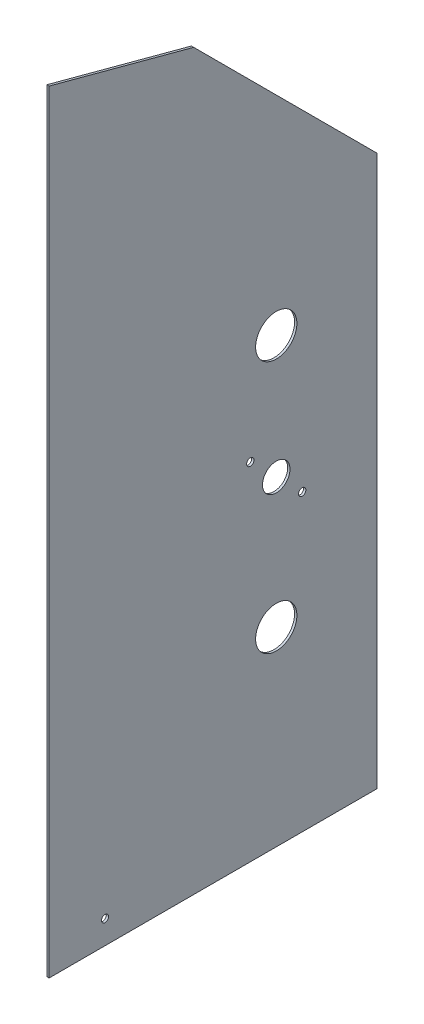
ISO-10303-21;
HEADER;
FILE_DESCRIPTION(('STEP AP214'),'2;1');
FILE_NAME('part.step','',(''),(''),'','','');
FILE_SCHEMA(('AUTOMOTIVE_DESIGN { 1 0 10303 214 1 1 1 1 }'));
ENDSEC;
DATA;
#1=APPLICATION_CONTEXT('core data for automotive mechanical design processes');
#2=APPLICATION_PROTOCOL_DEFINITION('international standard','automotive_design',2000,#1);
#3=PRODUCT_CONTEXT('',#1,'mechanical');
#4=PRODUCT('Part','Part','',(#3));
#5=PRODUCT_RELATED_PRODUCT_CATEGORY('part','',(#4));
#6=PRODUCT_DEFINITION_FORMATION('','',#4);
#7=PRODUCT_DEFINITION_CONTEXT('part definition',#1,'design');
#8=PRODUCT_DEFINITION('design','',#6,#7);
#9=PRODUCT_DEFINITION_SHAPE('','',#8);
#10=(LENGTH_UNIT() NAMED_UNIT(*) SI_UNIT(.MILLI.,.METRE.));
#11=(NAMED_UNIT(*) PLANE_ANGLE_UNIT() SI_UNIT($,.RADIAN.));
#12=(NAMED_UNIT(*) SI_UNIT($,.STERADIAN.) SOLID_ANGLE_UNIT());
#13=UNCERTAINTY_MEASURE_WITH_UNIT(LENGTH_MEASURE(1.E-05),#10,'distance_accuracy_value','');
#14=(GEOMETRIC_REPRESENTATION_CONTEXT(3) GLOBAL_UNCERTAINTY_ASSIGNED_CONTEXT((#13)) GLOBAL_UNIT_ASSIGNED_CONTEXT((#10,
#11,#12)) REPRESENTATION_CONTEXT('',''));
#15=CARTESIAN_POINT('',(0.,0.,0.));
#16=DIRECTION('',(0.,0.,1.));
#17=DIRECTION('',(1.,0.,0.));
#18=AXIS2_PLACEMENT_3D('',#15,#16,#17);
#19=CARTESIAN_POINT('',(1.5875,0.,0.));
#20=DIRECTION('',(1.,0.,0.));
#21=DIRECTION('',(0.,0.,-1.));
#22=AXIS2_PLACEMENT_3D('',#19,#20,#21);
#23=PLANE('',#22);
#24=CARTESIAN_POINT('',(1.5875,-237.687866,74.877168));
#25=DIRECTION('',(1.,0.,0.));
#26=DIRECTION('',(0.,0.,-1.));
#27=AXIS2_PLACEMENT_3D('',#24,#25,#26);
#28=CIRCLE('',#27,2.45745);
#29=CARTESIAN_POINT('',(1.5875,-237.687866,72.419718));
#30=VERTEX_POINT('',#29);
#31=EDGE_CURVE('E152',#30,#30,#28,.T.);
#32=ORIENTED_EDGE('',*,*,#31,.F.);
#33=EDGE_LOOP('',(#32));
#34=FACE_BOUND('',#33,.T.);
#35=CARTESIAN_POINT('',(1.5875,-14.2543077578617,-25.7274877578617));
#36=DIRECTION('',(1.,0.,0.));
#37=DIRECTION('',(0.,0.,-1.));
#38=AXIS2_PLACEMENT_3D('',#35,#36,#37);
#39=CIRCLE('',#38,2.55270000000001);
#40=CARTESIAN_POINT('',(1.5875,-14.2543077578617,-28.2801877578617));
#41=VERTEX_POINT('',#40);
#42=EDGE_CURVE('E135',#41,#41,#39,.T.);
#43=ORIENTED_EDGE('',*,*,#42,.F.);
#44=EDGE_LOOP('',(#43));
#45=FACE_BOUND('',#44,.T.);
#46=CARTESIAN_POINT('',(1.5875,52.78628,-43.688));
#47=DIRECTION('',(1.,0.,0.));
#48=DIRECTION('',(0.,0.,-1.));
#49=AXIS2_PLACEMENT_3D('',#46,#47,#48);
#50=CIRCLE('',#49,14.2875);
#51=CARTESIAN_POINT('',(1.5875,52.78628,-57.9755));
#52=VERTEX_POINT('',#51);
#53=EDGE_CURVE('E123',#52,#52,#50,.T.);
#54=ORIENTED_EDGE('',*,*,#53,.F.);
#55=EDGE_LOOP('',(#54));
#56=FACE_BOUND('',#55,.T.);
#57=DIRECTION('',(0.,1.,0.));
#58=VECTOR('',#57,1.);
#59=CARTESIAN_POINT('',(1.5875,254.,-113.538));
#60=LINE('',#59,#58);
#61=CARTESIAN_POINT('',(1.5875,-254.,-113.538));
#62=VERTEX_POINT('',#61);
#63=CARTESIAN_POINT('',(1.5875,127.,-113.538));
#64=VERTEX_POINT('',#63);
#65=EDGE_CURVE('E111',#62,#64,#60,.T.);
#66=ORIENTED_EDGE('',*,*,#65,.T.);
#67=DIRECTION('',(0.,-0.707106781186549,-0.707106781186546));
#68=VECTOR('',#67,1.);
#69=CARTESIAN_POINT('',(1.5875,120.269,-120.269));
#70=LINE('',#69,#68);
#71=CARTESIAN_POINT('',(1.5875,254.,13.462));
#72=VERTEX_POINT('',#71);
#73=EDGE_CURVE('E11',#64,#72,#70,.F.);
#74=ORIENTED_EDGE('',*,*,#73,.T.);
#75=DIRECTION('',(0.,0.258819045102515,0.96592582628907));
#76=VECTOR('',#75,1.);
#77=CARTESIAN_POINT('',(1.5875,254.,13.462));
#78=LINE('',#77,#76);
#79=CARTESIAN_POINT('',(1.5875,280.815283381736,113.538));
#80=VERTEX_POINT('',#79);
#81=EDGE_CURVE('E89',#72,#80,#78,.T.);
#82=ORIENTED_EDGE('',*,*,#81,.T.);
#83=DIRECTION('',(0.,-1.,0.));
#84=VECTOR('',#83,1.);
#85=CARTESIAN_POINT('',(1.5875,254.,113.538));
#86=LINE('',#85,#84);
#87=CARTESIAN_POINT('',(1.5875,-254.,113.538));
#88=VERTEX_POINT('',#87);
#89=EDGE_CURVE('E117',#80,#88,#86,.T.);
#90=ORIENTED_EDGE('',*,*,#89,.T.);
#91=DIRECTION('',(0.,0.,-1.));
#92=VECTOR('',#91,1.);
#93=CARTESIAN_POINT('',(1.5875,-254.,113.538));
#94=LINE('',#93,#92);
#95=EDGE_CURVE('E108',#88,#62,#94,.T.);
#96=ORIENTED_EDGE('',*,*,#95,.T.);
#97=EDGE_LOOP('',(#66,#74,#82,#90,#96));
#98=FACE_BOUND('',#97,.T.);
#99=CARTESIAN_POINT('',(1.5875,-122.2375,-43.688));
#100=DIRECTION('',(1.,0.,0.));
#101=DIRECTION('',(0.,0.,-1.));
#102=AXIS2_PLACEMENT_3D('',#99,#100,#101);
#103=CIRCLE('',#102,14.2875);
#104=CARTESIAN_POINT('',(1.5875,-122.2375,-57.9755));
#105=VERTEX_POINT('',#104);
#106=EDGE_CURVE('E115',#105,#105,#103,.T.);
#107=ORIENTED_EDGE('',*,*,#106,.F.);
#108=EDGE_LOOP('',(#107));
#109=FACE_BOUND('',#108,.T.);
#110=CARTESIAN_POINT('',(1.5875,-32.21482,-43.688));
#111=DIRECTION('',(1.,0.,0.));
#112=DIRECTION('',(0.,0.,-1.));
#113=AXIS2_PLACEMENT_3D('',#110,#111,#112);
#114=CIRCLE('',#113,9.525);
#115=CARTESIAN_POINT('',(1.5875,-32.21482,-53.213));
#116=VERTEX_POINT('',#115);
#117=EDGE_CURVE('E129',#116,#116,#114,.T.);
#118=ORIENTED_EDGE('',*,*,#117,.F.);
#119=EDGE_LOOP('',(#118));
#120=FACE_BOUND('',#119,.T.);
#121=CARTESIAN_POINT('',(1.5875,-50.1753322421383,-61.6485122421384));
#122=DIRECTION('',(1.,0.,0.));
#123=DIRECTION('',(0.,0.,-1.));
#124=AXIS2_PLACEMENT_3D('',#121,#122,#123);
#125=CIRCLE('',#124,2.55270000000003);
#126=CARTESIAN_POINT('',(1.5875,-50.1753322421383,-64.2012122421384));
#127=VERTEX_POINT('',#126);
#128=EDGE_CURVE('E141',#127,#127,#125,.T.);
#129=ORIENTED_EDGE('',*,*,#128,.F.);
#130=EDGE_LOOP('',(#129));
#131=FACE_BOUND('',#130,.T.);
#132=ADVANCED_FACE('F35',(#34,#45,#56,#98,#109,#120,#131),#23,.T.);
#133=CARTESIAN_POINT('',(0.,0.,0.));
#134=DIRECTION('',(1.,0.,0.));
#135=DIRECTION('',(0.,0.,-1.));
#136=AXIS2_PLACEMENT_3D('',#133,#134,#135);
#137=PLANE('',#136);
#138=CARTESIAN_POINT('',(0.,-237.687866,74.877168));
#139=DIRECTION('',(1.,0.,0.));
#140=DIRECTION('',(0.,0.,-1.));
#141=AXIS2_PLACEMENT_3D('',#138,#139,#140);
#142=CIRCLE('',#141,2.45745);
#143=CARTESIAN_POINT('',(0.,-237.687866,72.419718));
#144=VERTEX_POINT('',#143);
#145=EDGE_CURVE('E147',#144,#144,#142,.T.);
#146=ORIENTED_EDGE('',*,*,#145,.T.);
#147=EDGE_LOOP('',(#146));
#148=FACE_BOUND('',#147,.T.);
#149=DIRECTION('',(0.,-1.,0.));
#150=VECTOR('',#149,1.);
#151=CARTESIAN_POINT('',(0.,254.,113.538));
#152=LINE('',#151,#150);
#153=CARTESIAN_POINT('',(0.,280.815283381736,113.538));
#154=VERTEX_POINT('',#153);
#155=CARTESIAN_POINT('',(0.,-254.,113.538));
#156=VERTEX_POINT('',#155);
#157=EDGE_CURVE('E97',#154,#156,#152,.T.);
#158=ORIENTED_EDGE('',*,*,#157,.F.);
#159=DIRECTION('',(0.,0.258819045102515,0.96592582628907));
#160=VECTOR('',#159,1.);
#161=CARTESIAN_POINT('',(0.,254.,13.462));
#162=LINE('',#161,#160);
#163=CARTESIAN_POINT('',(0.,254.,13.462));
#164=VERTEX_POINT('',#163);
#165=EDGE_CURVE('E87',#164,#154,#162,.T.);
#166=ORIENTED_EDGE('',*,*,#165,.F.);
#167=DIRECTION('',(0.,0.707106781186549,0.707106781186546));
#168=VECTOR('',#167,1.);
#169=CARTESIAN_POINT('',(0.,254.,13.462));
#170=LINE('',#169,#168);
#171=CARTESIAN_POINT('',(0.,127.,-113.538));
#172=VERTEX_POINT('',#171);
#173=EDGE_CURVE('E57',#164,#172,#170,.F.);
#174=ORIENTED_EDGE('',*,*,#173,.T.);
#175=DIRECTION('',(0.,1.,0.));
#176=VECTOR('',#175,1.);
#177=CARTESIAN_POINT('',(0.,254.,-113.538));
#178=LINE('',#177,#176);
#179=CARTESIAN_POINT('',(0.,-254.,-113.538));
#180=VERTEX_POINT('',#179);
#181=EDGE_CURVE('E113',#180,#172,#178,.T.);
#182=ORIENTED_EDGE('',*,*,#181,.F.);
#183=DIRECTION('',(0.,0.,-1.));
#184=VECTOR('',#183,1.);
#185=CARTESIAN_POINT('',(0.,-254.,113.538));
#186=LINE('',#185,#184);
#187=EDGE_CURVE('E109',#156,#180,#186,.T.);
#188=ORIENTED_EDGE('',*,*,#187,.F.);
#189=EDGE_LOOP('',(#158,#166,#174,#182,#188));
#190=FACE_BOUND('',#189,.T.);
#191=CARTESIAN_POINT('',(0.,-122.2375,-43.688));
#192=DIRECTION('',(1.,0.,0.));
#193=DIRECTION('',(0.,0.,-1.));
#194=AXIS2_PLACEMENT_3D('',#191,#192,#193);
#195=CIRCLE('',#194,14.2875);
#196=CARTESIAN_POINT('',(0.,-122.2375,-57.9755));
#197=VERTEX_POINT('',#196);
#198=EDGE_CURVE('E120',#197,#197,#195,.T.);
#199=ORIENTED_EDGE('',*,*,#198,.T.);
#200=EDGE_LOOP('',(#199));
#201=FACE_BOUND('',#200,.T.);
#202=CARTESIAN_POINT('',(0.,52.78628,-43.688));
#203=DIRECTION('',(1.,0.,0.));
#204=DIRECTION('',(0.,0.,-1.));
#205=AXIS2_PLACEMENT_3D('',#202,#203,#204);
#206=CIRCLE('',#205,14.2875);
#207=CARTESIAN_POINT('',(0.,52.78628,-57.9755));
#208=VERTEX_POINT('',#207);
#209=EDGE_CURVE('E126',#208,#208,#206,.T.);
#210=ORIENTED_EDGE('',*,*,#209,.T.);
#211=EDGE_LOOP('',(#210));
#212=FACE_BOUND('',#211,.T.);
#213=CARTESIAN_POINT('',(0.,-32.21482,-43.688));
#214=DIRECTION('',(1.,0.,0.));
#215=DIRECTION('',(0.,0.,-1.));
#216=AXIS2_PLACEMENT_3D('',#213,#214,#215);
#217=CIRCLE('',#216,9.525);
#218=CARTESIAN_POINT('',(0.,-32.21482,-53.213));
#219=VERTEX_POINT('',#218);
#220=EDGE_CURVE('E132',#219,#219,#217,.T.);
#221=ORIENTED_EDGE('',*,*,#220,.T.);
#222=EDGE_LOOP('',(#221));
#223=FACE_BOUND('',#222,.T.);
#224=CARTESIAN_POINT('',(0.,-14.2543077578617,-25.7274877578617));
#225=DIRECTION('',(1.,0.,0.));
#226=DIRECTION('',(0.,0.,-1.));
#227=AXIS2_PLACEMENT_3D('',#224,#225,#226);
#228=CIRCLE('',#227,2.55270000000001);
#229=CARTESIAN_POINT('',(0.,-14.2543077578617,-28.2801877578617));
#230=VERTEX_POINT('',#229);
#231=EDGE_CURVE('E138',#230,#230,#228,.T.);
#232=ORIENTED_EDGE('',*,*,#231,.T.);
#233=EDGE_LOOP('',(#232));
#234=FACE_BOUND('',#233,.T.);
#235=CARTESIAN_POINT('',(0.,-50.1753322421383,-61.6485122421384));
#236=DIRECTION('',(1.,0.,0.));
#237=DIRECTION('',(0.,0.,-1.));
#238=AXIS2_PLACEMENT_3D('',#235,#236,#237);
#239=CIRCLE('',#238,2.55270000000003);
#240=CARTESIAN_POINT('',(0.,-50.1753322421383,-64.2012122421384));
#241=VERTEX_POINT('',#240);
#242=EDGE_CURVE('E144',#241,#241,#239,.T.);
#243=ORIENTED_EDGE('',*,*,#242,.T.);
#244=EDGE_LOOP('',(#243));
#245=FACE_BOUND('',#244,.T.);
#246=ADVANCED_FACE('F94',(#148,#190,#201,#212,#223,#234,#245),#137,.F.);
#247=CARTESIAN_POINT('',(1.5875,254.,-113.538));
#248=DIRECTION('',(0.,0.,1.));
#249=DIRECTION('',(0.,-1.,0.));
#250=AXIS2_PLACEMENT_3D('',#247,#248,#249);
#251=PLANE('',#250);
#252=ORIENTED_EDGE('',*,*,#181,.T.);
#253=DIRECTION('',(1.,0.,0.));
#254=VECTOR('',#253,1.);
#255=CARTESIAN_POINT('',(1.5875,127.,-113.538));
#256=LINE('',#255,#254);
#257=EDGE_CURVE('E43',#172,#64,#256,.T.);
#258=ORIENTED_EDGE('',*,*,#257,.T.);
#259=ORIENTED_EDGE('',*,*,#65,.F.);
#260=DIRECTION('',(-1.,0.,0.));
#261=VECTOR('',#260,1.);
#262=CARTESIAN_POINT('',(1.5875,-254.,-113.538));
#263=LINE('',#262,#261);
#264=EDGE_CURVE('E105',#62,#180,#263,.T.);
#265=ORIENTED_EDGE('',*,*,#264,.T.);
#266=EDGE_LOOP('',(#252,#258,#259,#265));
#267=FACE_BOUND('',#266,.T.);
#268=ADVANCED_FACE('F161',(#267),#251,.F.);
#269=CARTESIAN_POINT('',(1.5875,254.,113.538));
#270=DIRECTION('',(0.,0.,-1.));
#271=DIRECTION('',(0.,1.,0.));
#272=AXIS2_PLACEMENT_3D('',#269,#270,#271);
#273=PLANE('',#272);
#274=ORIENTED_EDGE('',*,*,#157,.T.);
#275=DIRECTION('',(-1.,0.,0.));
#276=VECTOR('',#275,1.);
#277=CARTESIAN_POINT('',(1.5875,-254.,113.538));
#278=LINE('',#277,#276);
#279=EDGE_CURVE('E92',#88,#156,#278,.T.);
#280=ORIENTED_EDGE('',*,*,#279,.F.);
#281=ORIENTED_EDGE('',*,*,#89,.F.);
#282=DIRECTION('',(1.,0.,0.));
#283=VECTOR('',#282,1.);
#284=CARTESIAN_POINT('',(0.,280.815283381736,113.538));
#285=LINE('',#284,#283);
#286=EDGE_CURVE('E99',#154,#80,#285,.T.);
#287=ORIENTED_EDGE('',*,*,#286,.F.);
#288=EDGE_LOOP('',(#274,#280,#281,#287));
#289=FACE_BOUND('',#288,.T.);
#290=ADVANCED_FACE('F165',(#289),#273,.F.);
#291=CARTESIAN_POINT('',(1.5875,-254.,113.538));
#292=DIRECTION('',(0.,1.,0.));
#293=DIRECTION('',(0.,0.,1.));
#294=AXIS2_PLACEMENT_3D('',#291,#292,#293);
#295=PLANE('',#294);
#296=ORIENTED_EDGE('',*,*,#187,.T.);
#297=ORIENTED_EDGE('',*,*,#264,.F.);
#298=ORIENTED_EDGE('',*,*,#95,.F.);
#299=ORIENTED_EDGE('',*,*,#279,.T.);
#300=EDGE_LOOP('',(#296,#297,#298,#299));
#301=FACE_BOUND('',#300,.T.);
#302=ADVANCED_FACE('F163',(#301),#295,.F.);
#303=CARTESIAN_POINT('',(1.5875,-122.2375,-43.688));
#304=DIRECTION('',(-1.,0.,0.));
#305=DIRECTION('',(0.,0.,1.));
#306=AXIS2_PLACEMENT_3D('',#303,#304,#305);
#307=CYLINDRICAL_SURFACE('',#306,14.2875);
#308=ORIENTED_EDGE('',*,*,#106,.T.);
#309=EDGE_LOOP('',(#308));
#310=FACE_BOUND('',#309,.T.);
#311=ORIENTED_EDGE('',*,*,#198,.F.);
#312=EDGE_LOOP('',(#311));
#313=FACE_BOUND('',#312,.T.);
#314=ADVANCED_FACE('F172',(#310,#313),#307,.F.);
#315=CARTESIAN_POINT('',(1.5875,52.78628,-43.688));
#316=DIRECTION('',(-1.,0.,0.));
#317=DIRECTION('',(0.,0.,1.));
#318=AXIS2_PLACEMENT_3D('',#315,#316,#317);
#319=CYLINDRICAL_SURFACE('',#318,14.2875);
#320=ORIENTED_EDGE('',*,*,#53,.T.);
#321=EDGE_LOOP('',(#320));
#322=FACE_BOUND('',#321,.T.);
#323=ORIENTED_EDGE('',*,*,#209,.F.);
#324=EDGE_LOOP('',(#323));
#325=FACE_BOUND('',#324,.T.);
#326=ADVANCED_FACE('F187',(#322,#325),#319,.F.);
#327=CARTESIAN_POINT('',(1.5875,-32.21482,-43.688));
#328=DIRECTION('',(-1.,0.,0.));
#329=DIRECTION('',(0.,0.,1.));
#330=AXIS2_PLACEMENT_3D('',#327,#328,#329);
#331=CYLINDRICAL_SURFACE('',#330,9.525);
#332=ORIENTED_EDGE('',*,*,#117,.T.);
#333=EDGE_LOOP('',(#332));
#334=FACE_BOUND('',#333,.T.);
#335=ORIENTED_EDGE('',*,*,#220,.F.);
#336=EDGE_LOOP('',(#335));
#337=FACE_BOUND('',#336,.T.);
#338=ADVANCED_FACE('F191',(#334,#337),#331,.F.);
#339=CARTESIAN_POINT('',(1.5875,-14.2543077578617,-25.7274877578617));
#340=DIRECTION('',(-1.,0.,0.));
#341=DIRECTION('',(0.,0.,1.));
#342=AXIS2_PLACEMENT_3D('',#339,#340,#341);
#343=CYLINDRICAL_SURFACE('',#342,2.55270000000001);
#344=ORIENTED_EDGE('',*,*,#42,.T.);
#345=EDGE_LOOP('',(#344));
#346=FACE_BOUND('',#345,.T.);
#347=ORIENTED_EDGE('',*,*,#231,.F.);
#348=EDGE_LOOP('',(#347));
#349=FACE_BOUND('',#348,.T.);
#350=ADVANCED_FACE('F195',(#346,#349),#343,.F.);
#351=CARTESIAN_POINT('',(1.5875,-50.1753322421383,-61.6485122421384));
#352=DIRECTION('',(-1.,0.,0.));
#353=DIRECTION('',(0.,0.,1.));
#354=AXIS2_PLACEMENT_3D('',#351,#352,#353);
#355=CYLINDRICAL_SURFACE('',#354,2.55270000000003);
#356=ORIENTED_EDGE('',*,*,#128,.T.);
#357=EDGE_LOOP('',(#356));
#358=FACE_BOUND('',#357,.T.);
#359=ORIENTED_EDGE('',*,*,#242,.F.);
#360=EDGE_LOOP('',(#359));
#361=FACE_BOUND('',#360,.T.);
#362=ADVANCED_FACE('F199',(#358,#361),#355,.F.);
#363=CARTESIAN_POINT('',(1.5875,-237.687866,74.877168));
#364=DIRECTION('',(1.,0.,0.));
#365=DIRECTION('',(0.,0.,-1.));
#366=AXIS2_PLACEMENT_3D('',#363,#364,#365);
#367=CYLINDRICAL_SURFACE('',#366,2.45745);
#368=ORIENTED_EDGE('',*,*,#145,.F.);
#369=EDGE_LOOP('',(#368));
#370=FACE_BOUND('',#369,.T.);
#371=ORIENTED_EDGE('',*,*,#31,.T.);
#372=EDGE_LOOP('',(#371));
#373=FACE_BOUND('',#372,.T.);
#374=ADVANCED_FACE('F203',(#370,#373),#367,.F.);
#375=CARTESIAN_POINT('',(1.5875,254.,13.462));
#376=DIRECTION('',(0.,-0.707106781186546,0.707106781186549));
#377=DIRECTION('',(-1.,0.,0.));
#378=AXIS2_PLACEMENT_3D('',#375,#376,#377);
#379=PLANE('',#378);
#380=ORIENTED_EDGE('',*,*,#73,.F.);
#381=ORIENTED_EDGE('',*,*,#257,.F.);
#382=ORIENTED_EDGE('',*,*,#173,.F.);
#383=DIRECTION('',(-1.,0.,0.));
#384=VECTOR('',#383,1.);
#385=CARTESIAN_POINT('',(1.5875,254.,13.462));
#386=LINE('',#385,#384);
#387=EDGE_CURVE('E84',#72,#164,#386,.T.);
#388=ORIENTED_EDGE('',*,*,#387,.F.);
#389=EDGE_LOOP('',(#380,#381,#382,#388));
#390=FACE_BOUND('',#389,.T.);
#391=ADVANCED_FACE('F37',(#390),#379,.F.);
#392=CARTESIAN_POINT('',(0.,254.,13.462));
#393=DIRECTION('',(0.,0.96592582628907,-0.258819045102515));
#394=DIRECTION('',(0.,0.258819045102515,0.96592582628907));
#395=AXIS2_PLACEMENT_3D('',#392,#393,#394);
#396=PLANE('',#395);
#397=ORIENTED_EDGE('',*,*,#81,.F.);
#398=ORIENTED_EDGE('',*,*,#387,.T.);
#399=ORIENTED_EDGE('',*,*,#165,.T.);
#400=ORIENTED_EDGE('',*,*,#286,.T.);
#401=EDGE_LOOP('',(#397,#398,#399,#400));
#402=FACE_BOUND('',#401,.T.);
#403=ADVANCED_FACE('F85',(#402),#396,.T.);
#404=CLOSED_SHELL('',(#132,#246,#268,#290,#302,#314,#326,#338,#350,#362,#374,#391,#403));
#405=MANIFOLD_SOLID_BREP('B2',#404);
#406=ADVANCED_BREP_SHAPE_REPRESENTATION('',(#18,#405),#14);
#407=SHAPE_DEFINITION_REPRESENTATION(#9,#406);
ENDSEC;
END-ISO-10303-21;
